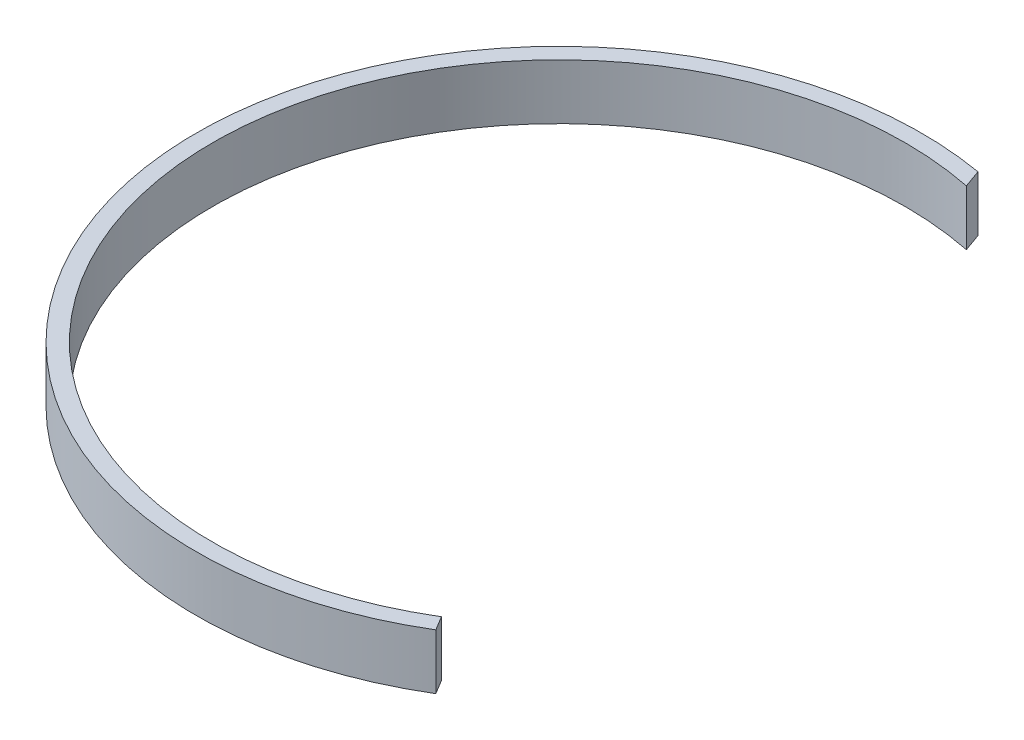
ISO-10303-21;
HEADER;
FILE_DESCRIPTION(('STEP AP214'),'2;1');
FILE_NAME('part.step','',(''),(''),'','','');
FILE_SCHEMA(('AUTOMOTIVE_DESIGN { 1 0 10303 214 1 1 1 1 }'));
ENDSEC;
DATA;
#1=APPLICATION_CONTEXT('core data for automotive mechanical design processes');
#2=APPLICATION_PROTOCOL_DEFINITION('international standard','automotive_design',2000,#1);
#3=PRODUCT_CONTEXT('',#1,'mechanical');
#4=PRODUCT('Part','Part','',(#3));
#5=PRODUCT_RELATED_PRODUCT_CATEGORY('part','',(#4));
#6=PRODUCT_DEFINITION_FORMATION('','',#4);
#7=PRODUCT_DEFINITION_CONTEXT('part definition',#1,'design');
#8=PRODUCT_DEFINITION('design','',#6,#7);
#9=PRODUCT_DEFINITION_SHAPE('','',#8);
#10=(LENGTH_UNIT() NAMED_UNIT(*) SI_UNIT(.MILLI.,.METRE.));
#11=(NAMED_UNIT(*) PLANE_ANGLE_UNIT() SI_UNIT($,.RADIAN.));
#12=(NAMED_UNIT(*) SI_UNIT($,.STERADIAN.) SOLID_ANGLE_UNIT());
#13=UNCERTAINTY_MEASURE_WITH_UNIT(LENGTH_MEASURE(1.E-05),#10,'distance_accuracy_value','');
#14=(GEOMETRIC_REPRESENTATION_CONTEXT(3) GLOBAL_UNCERTAINTY_ASSIGNED_CONTEXT((#13)) GLOBAL_UNIT_ASSIGNED_CONTEXT((#10,
#11,#12)) REPRESENTATION_CONTEXT('',''));
#15=CARTESIAN_POINT('',(0.,0.,0.));
#16=DIRECTION('',(0.,0.,1.));
#17=DIRECTION('',(1.,0.,0.));
#18=AXIS2_PLACEMENT_3D('',#15,#16,#17);
#19=CARTESIAN_POINT('',(145.719440182729,10.,-180.148984957569));
#20=DIRECTION('',(0.,-1.,0.));
#21=DIRECTION('',(0.,0.,-1.));
#22=AXIS2_PLACEMENT_3D('',#19,#20,#21);
#23=CYLINDRICAL_SURFACE('',#22,65.5946471571457);
#24=CARTESIAN_POINT('',(145.719440182729,0.,-180.148984957569));
#25=DIRECTION('',(0.,1.,0.));
#26=DIRECTION('',(0.,0.,1.));
#27=AXIS2_PLACEMENT_3D('',#24,#25,#26);
#28=CIRCLE('',#27,65.5946471571457);
#29=CARTESIAN_POINT('',(156.897608816099,0.,-244.78416331792));
#30=VERTEX_POINT('',#29);
#31=CARTESIAN_POINT('',(179.618589832162,0.,-123.992904354345));
#32=VERTEX_POINT('',#31);
#33=EDGE_CURVE('E93',#30,#32,#28,.T.);
#34=ORIENTED_EDGE('',*,*,#33,.T.);
#35=DIRECTION('',(0.,-1.,0.));
#36=VECTOR('',#35,1.);
#37=CARTESIAN_POINT('',(179.618589832162,10.,-123.992904354345));
#38=LINE('',#37,#36);
#39=CARTESIAN_POINT('',(179.618589832162,10.,-123.992904354345));
#40=VERTEX_POINT('',#39);
#41=EDGE_CURVE('E11',#40,#32,#38,.T.);
#42=ORIENTED_EDGE('',*,*,#41,.F.);
#43=CARTESIAN_POINT('',(145.719440182729,10.,-180.148984957569));
#44=DIRECTION('',(0.,1.,0.));
#45=DIRECTION('',(0.,0.,1.));
#46=AXIS2_PLACEMENT_3D('',#43,#44,#45);
#47=CIRCLE('',#46,65.5946471571457);
#48=CARTESIAN_POINT('',(156.897608816099,10.,-244.78416331792));
#49=VERTEX_POINT('',#48);
#50=EDGE_CURVE('E81',#49,#40,#47,.T.);
#51=ORIENTED_EDGE('',*,*,#50,.F.);
#52=DIRECTION('',(0.,-1.,0.));
#53=VECTOR('',#52,1.);
#54=CARTESIAN_POINT('',(156.897608816099,10.,-244.78416331792));
#55=LINE('',#54,#53);
#56=EDGE_CURVE('E89',#49,#30,#55,.T.);
#57=ORIENTED_EDGE('',*,*,#56,.T.);
#58=EDGE_LOOP('',(#34,#42,#51,#57));
#59=FACE_BOUND('',#58,.T.);
#60=ADVANCED_FACE('F30',(#59),#23,.T.);
#61=CARTESIAN_POINT('',(178.073766339579,10.,-126.552001956037));
#62=DIRECTION('',(-0.856107670930682,0.,0.516797499774954));
#63=DIRECTION('',(0.516797499774954,0.,0.856107670930682));
#64=AXIS2_PLACEMENT_3D('',#61,#62,#63);
#65=PLANE('',#64);
#66=DIRECTION('',(-0.516797499774954,0.,-0.856107670930682));
#67=VECTOR('',#66,1.);
#68=CARTESIAN_POINT('',(178.073766339579,0.,-126.552001956037));
#69=LINE('',#68,#67);
#70=CARTESIAN_POINT('',(178.073766339579,0.,-126.552001956037));
#71=VERTEX_POINT('',#70);
#72=EDGE_CURVE('E85',#32,#71,#69,.T.);
#73=ORIENTED_EDGE('',*,*,#72,.T.);
#74=DIRECTION('',(0.,-1.,0.));
#75=VECTOR('',#74,1.);
#76=CARTESIAN_POINT('',(178.073766339579,10.,-126.552001956037));
#77=LINE('',#76,#75);
#78=CARTESIAN_POINT('',(178.073766339579,10.,-126.552001956037));
#79=VERTEX_POINT('',#78);
#80=EDGE_CURVE('E38',#79,#71,#77,.T.);
#81=ORIENTED_EDGE('',*,*,#80,.F.);
#82=DIRECTION('',(-0.516797499774954,0.,-0.856107670930682));
#83=VECTOR('',#82,1.);
#84=CARTESIAN_POINT('',(178.073766339579,10.,-126.552001956037));
#85=LINE('',#84,#83);
#86=EDGE_CURVE('E76',#40,#79,#85,.T.);
#87=ORIENTED_EDGE('',*,*,#86,.F.);
#88=ORIENTED_EDGE('',*,*,#41,.T.);
#89=EDGE_LOOP('',(#73,#81,#87,#88));
#90=FACE_BOUND('',#89,.T.);
#91=ADVANCED_FACE('F84',(#90),#65,.F.);
#92=CARTESIAN_POINT('',(145.719440182729,10.,-180.148984957569));
#93=DIRECTION('',(0.,-1.,0.));
#94=DIRECTION('',(0.,0.,-1.));
#95=AXIS2_PLACEMENT_3D('',#92,#93,#94);
#96=CYLINDRICAL_SURFACE('',#95,62.6054231511165);
#97=CARTESIAN_POINT('',(145.719440182729,0.,-180.148984957569));
#98=DIRECTION('',(0.,-1.,0.));
#99=DIRECTION('',(0.,0.,1.));
#100=AXIS2_PLACEMENT_3D('',#97,#98,#99);
#101=CIRCLE('',#100,62.6054231511165);
#102=CARTESIAN_POINT('',(158.053716063805,0.,-241.527357748153));
#103=VERTEX_POINT('',#102);
#104=EDGE_CURVE('E63',#71,#103,#101,.T.);
#105=ORIENTED_EDGE('',*,*,#104,.T.);
#106=DIRECTION('',(0.,-1.,0.));
#107=VECTOR('',#106,1.);
#108=CARTESIAN_POINT('',(158.053716063805,10.,-241.527357748153));
#109=LINE('',#108,#107);
#110=CARTESIAN_POINT('',(158.053716063805,10.,-241.527357748153));
#111=VERTEX_POINT('',#110);
#112=EDGE_CURVE('E86',#111,#103,#109,.T.);
#113=ORIENTED_EDGE('',*,*,#112,.F.);
#114=CARTESIAN_POINT('',(145.719440182729,10.,-180.148984957569));
#115=DIRECTION('',(0.,-1.,0.));
#116=DIRECTION('',(0.,0.,1.));
#117=AXIS2_PLACEMENT_3D('',#114,#115,#116);
#118=CIRCLE('',#117,62.6054231511165);
#119=EDGE_CURVE('E79',#79,#111,#118,.T.);
#120=ORIENTED_EDGE('',*,*,#119,.F.);
#121=ORIENTED_EDGE('',*,*,#80,.T.);
#122=EDGE_LOOP('',(#105,#113,#120,#121));
#123=FACE_BOUND('',#122,.T.);
#124=ADVANCED_FACE('F87',(#123),#96,.F.);
#125=CARTESIAN_POINT('',(158.053716063805,10.,-241.527357748153));
#126=DIRECTION('',(-0.942385190476857,0.,0.334529748706896));
#127=DIRECTION('',(0.334529748706896,0.,0.942385190476857));
#128=AXIS2_PLACEMENT_3D('',#125,#126,#127);
#129=PLANE('',#128);
#130=DIRECTION('',(-0.334529748706896,0.,-0.942385190476857));
#131=VECTOR('',#130,1.);
#132=CARTESIAN_POINT('',(158.053716063805,0.,-241.527357748153));
#133=LINE('',#132,#131);
#134=EDGE_CURVE('E69',#103,#30,#133,.T.);
#135=ORIENTED_EDGE('',*,*,#134,.T.);
#136=ORIENTED_EDGE('',*,*,#56,.F.);
#137=DIRECTION('',(-0.334529748706896,0.,-0.942385190476857));
#138=VECTOR('',#137,1.);
#139=CARTESIAN_POINT('',(158.053716063805,10.,-241.527357748153));
#140=LINE('',#139,#138);
#141=EDGE_CURVE('E46',#111,#49,#140,.T.);
#142=ORIENTED_EDGE('',*,*,#141,.F.);
#143=ORIENTED_EDGE('',*,*,#112,.T.);
#144=EDGE_LOOP('',(#135,#136,#142,#143));
#145=FACE_BOUND('',#144,.T.);
#146=ADVANCED_FACE('F100',(#145),#129,.F.);
#147=CARTESIAN_POINT('',(145.719440182729,10.,-180.148984957569));
#148=DIRECTION('',(0.,1.,0.));
#149=DIRECTION('',(0.,0.,1.));
#150=AXIS2_PLACEMENT_3D('',#147,#148,#149);
#151=PLANE('',#150);
#152=ORIENTED_EDGE('',*,*,#50,.T.);
#153=ORIENTED_EDGE('',*,*,#86,.T.);
#154=ORIENTED_EDGE('',*,*,#119,.T.);
#155=ORIENTED_EDGE('',*,*,#141,.T.);
#156=EDGE_LOOP('',(#152,#153,#154,#155));
#157=FACE_BOUND('',#156,.T.);
#158=ADVANCED_FACE('F77',(#157),#151,.T.);
#159=CARTESIAN_POINT('',(145.719440182729,0.,-180.148984957569));
#160=DIRECTION('',(0.,1.,0.));
#161=DIRECTION('',(0.,0.,1.));
#162=AXIS2_PLACEMENT_3D('',#159,#160,#161);
#163=PLANE('',#162);
#164=ORIENTED_EDGE('',*,*,#33,.F.);
#165=ORIENTED_EDGE('',*,*,#134,.F.);
#166=ORIENTED_EDGE('',*,*,#104,.F.);
#167=ORIENTED_EDGE('',*,*,#72,.F.);
#168=EDGE_LOOP('',(#164,#165,#166,#167));
#169=FACE_BOUND('',#168,.T.);
#170=ADVANCED_FACE('F103',(#169),#163,.F.);
#171=CLOSED_SHELL('',(#60,#91,#124,#146,#158,#170));
#172=MANIFOLD_SOLID_BREP('B2',#171);
#173=ADVANCED_BREP_SHAPE_REPRESENTATION('',(#18,#172),#14);
#174=SHAPE_DEFINITION_REPRESENTATION(#9,#173);
ENDSEC;
END-ISO-10303-21;
